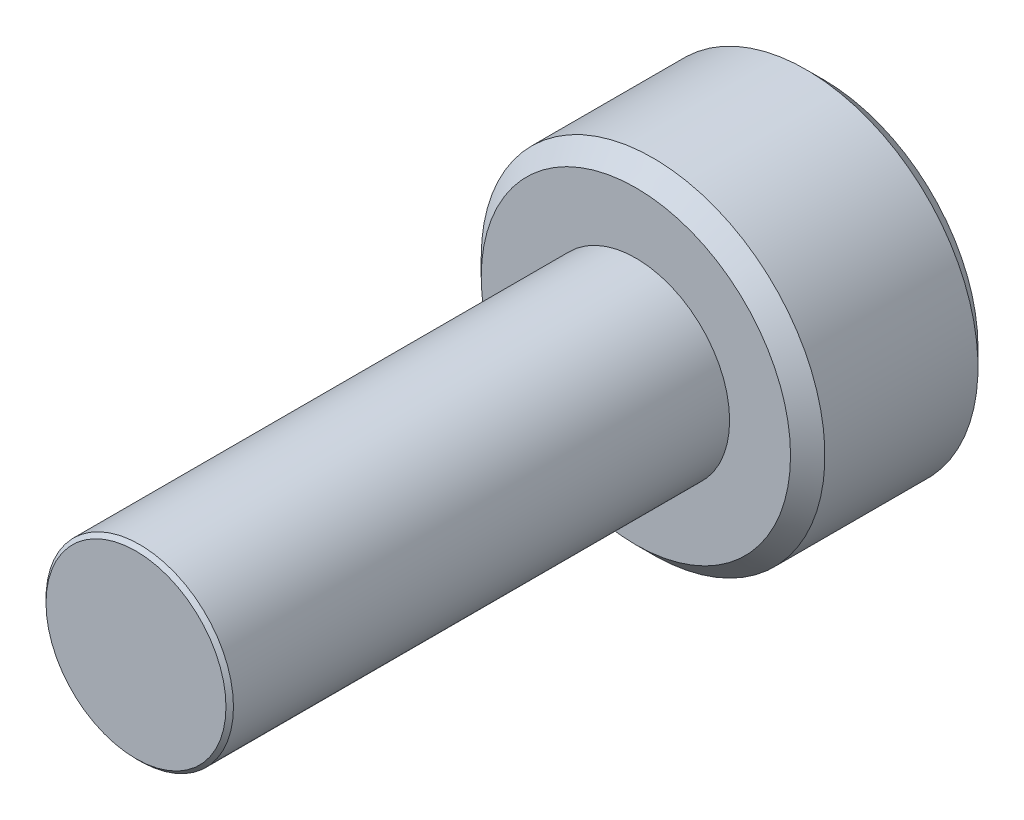
ISO-10303-21;
HEADER;
FILE_DESCRIPTION(('STEP AP214'),'2;1');
FILE_NAME('part.step','',(''),(''),'','','');
FILE_SCHEMA(('AUTOMOTIVE_DESIGN { 1 0 10303 214 1 1 1 1 }'));
ENDSEC;
DATA;
#1=APPLICATION_CONTEXT('core data for automotive mechanical design processes');
#2=APPLICATION_PROTOCOL_DEFINITION('international standard','automotive_design',2000,#1);
#3=PRODUCT_CONTEXT('',#1,'mechanical');
#4=PRODUCT('Part','Part','',(#3));
#5=PRODUCT_RELATED_PRODUCT_CATEGORY('part','',(#4));
#6=PRODUCT_DEFINITION_FORMATION('','',#4);
#7=PRODUCT_DEFINITION_CONTEXT('part definition',#1,'design');
#8=PRODUCT_DEFINITION('design','',#6,#7);
#9=PRODUCT_DEFINITION_SHAPE('','',#8);
#10=(LENGTH_UNIT() NAMED_UNIT(*) SI_UNIT(.MILLI.,.METRE.));
#11=(NAMED_UNIT(*) PLANE_ANGLE_UNIT() SI_UNIT($,.RADIAN.));
#12=(NAMED_UNIT(*) SI_UNIT($,.STERADIAN.) SOLID_ANGLE_UNIT());
#13=UNCERTAINTY_MEASURE_WITH_UNIT(LENGTH_MEASURE(1.E-05),#10,'distance_accuracy_value','');
#14=(GEOMETRIC_REPRESENTATION_CONTEXT(3) GLOBAL_UNCERTAINTY_ASSIGNED_CONTEXT((#13)) GLOBAL_UNIT_ASSIGNED_CONTEXT((#10,
#11,#12)) REPRESENTATION_CONTEXT('',''));
#15=CARTESIAN_POINT('',(0.,0.,0.));
#16=DIRECTION('',(0.,0.,1.));
#17=DIRECTION('',(1.,0.,0.));
#18=AXIS2_PLACEMENT_3D('',#15,#16,#17);
#19=CARTESIAN_POINT('',(0.,0.,-8.));
#20=DIRECTION('',(0.,0.,-1.));
#21=DIRECTION('',(-1.,0.,0.));
#22=AXIS2_PLACEMENT_3D('',#19,#20,#21);
#23=PLANE('',#22);
#24=CARTESIAN_POINT('',(0.,0.,-8.));
#25=DIRECTION('',(0.,0.,-1.));
#26=DIRECTION('',(-1.,0.,0.));
#27=AXIS2_PLACEMENT_3D('',#24,#25,#26);
#28=CIRCLE('',#27,2.475);
#29=CARTESIAN_POINT('',(-2.475,0.,-8.));
#30=VERTEX_POINT('',#29);
#31=EDGE_CURVE('E11',#30,#30,#28,.F.);
#32=ORIENTED_EDGE('',*,*,#31,.T.);
#33=EDGE_LOOP('',(#32));
#34=FACE_BOUND('',#33,.T.);
#35=CARTESIAN_POINT('',(0.,0.,-8.));
#36=DIRECTION('',(0.,0.,1.));
#37=DIRECTION('',(1.,0.,0.));
#38=AXIS2_PLACEMENT_3D('',#35,#36,#37);
#39=CIRCLE('',#38,1.5);
#40=CARTESIAN_POINT('',(1.5,0.,-8.));
#41=VERTEX_POINT('',#40);
#42=EDGE_CURVE('E118',#41,#41,#39,.T.);
#43=ORIENTED_EDGE('',*,*,#42,.F.);
#44=EDGE_LOOP('',(#43));
#45=FACE_BOUND('',#44,.T.);
#46=ADVANCED_FACE('F41',(#34,#45),#23,.F.);
#47=CARTESIAN_POINT('',(0.,0.,-8.));
#48=DIRECTION('',(0.,0.,1.));
#49=DIRECTION('',(1.,0.,0.));
#50=AXIS2_PLACEMENT_3D('',#47,#48,#49);
#51=CYLINDRICAL_SURFACE('',#50,1.5);
#52=ORIENTED_EDGE('',*,*,#42,.T.);
#53=EDGE_LOOP('',(#52));
#54=FACE_BOUND('',#53,.T.);
#55=CARTESIAN_POINT('',(0.,0.,-0.0599999999999993));
#56=DIRECTION('',(0.,0.,1.));
#57=DIRECTION('',(1.,0.,0.));
#58=AXIS2_PLACEMENT_3D('',#55,#56,#57);
#59=CIRCLE('',#58,1.5);
#60=CARTESIAN_POINT('',(1.5,0.,-0.0599999999999993));
#61=VERTEX_POINT('',#60);
#62=EDGE_CURVE('E146',#61,#61,#59,.F.);
#63=ORIENTED_EDGE('',*,*,#62,.T.);
#64=EDGE_LOOP('',(#63));
#65=FACE_BOUND('',#64,.T.);
#66=ADVANCED_FACE('F212',(#54,#65),#51,.T.);
#67=CARTESIAN_POINT('',(0.,0.,-11.));
#68=DIRECTION('',(0.,0.,1.));
#69=DIRECTION('',(1.,0.,0.));
#70=AXIS2_PLACEMENT_3D('',#67,#68,#69);
#71=CYLINDRICAL_SURFACE('',#70,2.75);
#72=CARTESIAN_POINT('',(0.,0.,-10.725));
#73=DIRECTION('',(0.,0.,-1.));
#74=DIRECTION('',(-1.,0.,0.));
#75=AXIS2_PLACEMENT_3D('',#72,#73,#74);
#76=CIRCLE('',#75,2.75);
#77=CARTESIAN_POINT('',(-2.75,0.,-10.725));
#78=VERTEX_POINT('',#77);
#79=EDGE_CURVE('E50',#78,#78,#76,.F.);
#80=ORIENTED_EDGE('',*,*,#79,.T.);
#81=EDGE_LOOP('',(#80));
#82=FACE_BOUND('',#81,.T.);
#83=CARTESIAN_POINT('',(0.,0.,-8.275));
#84=DIRECTION('',(0.,0.,-1.));
#85=DIRECTION('',(-1.,0.,0.));
#86=AXIS2_PLACEMENT_3D('',#83,#84,#85);
#87=CIRCLE('',#86,2.75);
#88=CARTESIAN_POINT('',(-2.75,0.,-8.275));
#89=VERTEX_POINT('',#88);
#90=EDGE_CURVE('E190',#89,#89,#87,.T.);
#91=ORIENTED_EDGE('',*,*,#90,.T.);
#92=EDGE_LOOP('',(#91));
#93=FACE_BOUND('',#92,.T.);
#94=ADVANCED_FACE('F197',(#82,#93),#71,.T.);
#95=CARTESIAN_POINT('',(0.,0.,-11.));
#96=DIRECTION('',(0.,0.,-1.));
#97=DIRECTION('',(-1.,0.,0.));
#98=AXIS2_PLACEMENT_3D('',#95,#96,#97);
#99=PLANE('',#98);
#100=CARTESIAN_POINT('',(0.,0.,-11.));
#101=DIRECTION('',(0.,0.,-1.));
#102=DIRECTION('',(-1.,0.,0.));
#103=AXIS2_PLACEMENT_3D('',#100,#101,#102);
#104=CIRCLE('',#103,2.475);
#105=CARTESIAN_POINT('',(-2.475,0.,-11.));
#106=VERTEX_POINT('',#105);
#107=EDGE_CURVE('E117',#106,#106,#104,.T.);
#108=ORIENTED_EDGE('',*,*,#107,.T.);
#109=EDGE_LOOP('',(#108));
#110=FACE_BOUND('',#109,.T.);
#111=CARTESIAN_POINT('',(0.,0.,-11.));
#112=DIRECTION('',(0.,0.,-1.));
#113=DIRECTION('',(-1.,0.,0.));
#114=AXIS2_PLACEMENT_3D('',#111,#112,#113);
#115=CIRCLE('',#114,1.44337567297406);
#116=CARTESIAN_POINT('',(-1.25,0.721687836487031,-11.));
#117=VERTEX_POINT('',#116);
#118=CARTESIAN_POINT('',(0.,1.44337567297406,-11.));
#119=VERTEX_POINT('',#118);
#120=EDGE_CURVE('E96',#117,#119,#115,.T.);
#121=ORIENTED_EDGE('',*,*,#120,.F.);
#122=CARTESIAN_POINT('',(-1.25,-0.721687836487032,-11.));
#123=VERTEX_POINT('',#122);
#124=EDGE_CURVE('E56',#123,#117,#115,.T.);
#125=ORIENTED_EDGE('',*,*,#124,.F.);
#126=CARTESIAN_POINT('',(0.,-1.44337567297406,-11.));
#127=VERTEX_POINT('',#126);
#128=EDGE_CURVE('E242',#127,#123,#115,.T.);
#129=ORIENTED_EDGE('',*,*,#128,.F.);
#130=CARTESIAN_POINT('',(1.25,-0.721687836487032,-11.));
#131=VERTEX_POINT('',#130);
#132=EDGE_CURVE('E63',#131,#127,#115,.T.);
#133=ORIENTED_EDGE('',*,*,#132,.F.);
#134=CARTESIAN_POINT('',(1.25,0.721687836487033,-11.));
#135=VERTEX_POINT('',#134);
#136=EDGE_CURVE('E141',#135,#131,#115,.T.);
#137=ORIENTED_EDGE('',*,*,#136,.F.);
#138=EDGE_CURVE('E106',#119,#135,#115,.T.);
#139=ORIENTED_EDGE('',*,*,#138,.F.);
#140=EDGE_LOOP('',(#121,#125,#129,#133,#137,#139));
#141=FACE_BOUND('',#140,.T.);
#142=ADVANCED_FACE('F140',(#110,#141),#99,.T.);
#143=CARTESIAN_POINT('',(0.,0.,-11.));
#144=DIRECTION('',(0.,0.,-1.));
#145=DIRECTION('',(-1.,0.,0.));
#146=AXIS2_PLACEMENT_3D('',#143,#144,#145);
#147=CONICAL_SURFACE('',#146,1.44337567297406,0.78539816339745);
#148=ORIENTED_EDGE('',*,*,#138,.T.);
#149=CARTESIAN_POINT('',(-0.000199999999999518,1.4434911430279,-11.0001154839091));
#150=CARTESIAN_POINT('',(0.0427751670715875,1.41867941875065,-10.9753216680551));
#151=CARTESIAN_POINT('',(0.0864690047459492,1.39345276980743,-10.9519837344187));
#152=CARTESIAN_POINT('',(0.175565930841943,1.34201263554194,-10.9092520040845));
#153=CARTESIAN_POINT('',(0.220977498357065,1.31579425481276,-10.8898819923604));
#154=CARTESIAN_POINT('',(0.312547820935261,1.26292610442246,-10.8567004834135));
#155=CARTESIAN_POINT('',(0.358683240175887,1.23628980770471,-10.8428055590527));
#156=CARTESIAN_POINT('',(0.451970080407593,1.18243062538508,-10.8213972821606));
#157=CARTESIAN_POINT('',(0.499118649136381,1.15520938653761,-10.8138679415668));
#158=CARTESIAN_POINT('',(0.580373556887253,1.10829684367467,-10.8070744980507));
#159=CARTESIAN_POINT('',(0.614374876627942,1.08866617256958,-10.8060685591043));
#160=CARTESIAN_POINT('',(0.682317764432479,1.04943932800611,-10.8077614149113));
#161=CARTESIAN_POINT('',(0.716259317655658,1.02984316311599,-10.8104610272155));
#162=CARTESIAN_POINT('',(0.7838148564575,0.990839954603498,-10.8194089303164));
#163=CARTESIAN_POINT('',(0.817428507286776,0.97143310424877,-10.8256605258997));
#164=CARTESIAN_POINT('',(0.884094638217814,0.932943395609905,-10.8413756814139));
#165=CARTESIAN_POINT('',(0.917146871030297,0.9138606800983,-10.8508406200875));
#166=CARTESIAN_POINT('',(1.00179969160026,0.864986351354567,-10.8789313906876));
#167=CARTESIAN_POINT('',(1.05286649242964,0.835502920149076,-10.8996701574522));
#168=CARTESIAN_POINT('',(1.15300085411325,0.777690319475909,-10.9463871346715));
#169=CARTESIAN_POINT('',(1.20207431157827,0.749357745598417,-10.9723482959468));
#170=CARTESIAN_POINT('',(1.2502,0.721572366433194,-11.0001154839091));
#171=B_SPLINE_CURVE_WITH_KNOTS('',3,(#149,#150,#151,#152,#153,#154,#155,#156,#157,#158,#159,
#160,#161,#162,#163,#164,#165,#166,#167,#168,#169,#170),.UNSPECIFIED.,.F.,.F.,(4,2,2,2,2,2,2,2,
2,2,4),(0.,0.166533409618305,0.334037607289762,0.498880396489699,0.663307919240275,
0.780963963458827,0.898645970148453,1.01643764860773,1.1342799317155,1.32148652032141,
1.50809158792573),.UNSPECIFIED.);
#172=EDGE_CURVE('E111',#119,#135,#171,.T.);
#173=ORIENTED_EDGE('',*,*,#172,.F.);
#174=EDGE_LOOP('',(#148,#173));
#175=FACE_BOUND('',#174,.T.);
#176=ADVANCED_FACE('F112',(#175),#147,.F.);
#177=ORIENTED_EDGE('',*,*,#136,.T.);
#178=CARTESIAN_POINT('',(1.25,-1.43934010808077,-11.4629820968923));
#179=CARTESIAN_POINT('',(1.25,-1.40429313005659,-11.4365249226329));
#180=CARTESIAN_POINT('',(1.25,-1.36905087135599,-11.4103271603543));
#181=CARTESIAN_POINT('',(1.25,-1.29809650706311,-11.3585575718396));
#182=CARTESIAN_POINT('',(1.25,-1.26238428576495,-11.3329859043563));
#183=CARTESIAN_POINT('',(1.25,-1.15390111792708,-11.2570059936895));
#184=CARTESIAN_POINT('',(1.25,-1.08031646726264,-11.2077402861896));
#185=CARTESIAN_POINT('',(1.25,-0.926012322755096,-11.1110258302631));
#186=CARTESIAN_POINT('',(1.25,-0.845125318656147,-11.0638412989418));
#187=CARTESIAN_POINT('',(1.25,-0.679311174076603,-10.9775307343904));
#188=CARTESIAN_POINT('',(1.25,-0.594398891026688,-10.9383775346269));
#189=CARTESIAN_POINT('',(1.25,-0.46694481246074,-10.8904772236883));
#190=CARTESIAN_POINT('',(1.25,-0.426289985812821,-10.8767294897863));
#191=CARTESIAN_POINT('',(1.25,-0.343998850091267,-10.8524979274505));
#192=CARTESIAN_POINT('',(1.25,-0.302362473614962,-10.8420143238698));
#193=CARTESIAN_POINT('',(1.25,-0.219052696285665,-10.8250301617483));
#194=CARTESIAN_POINT('',(1.25,-0.1773934284745,-10.8184613604714));
#195=CARTESIAN_POINT('',(1.25,-0.0936293693401921,-10.8094350534578));
#196=CARTESIAN_POINT('',(1.25,-0.051524655854396,-10.8069768409973));
#197=CARTESIAN_POINT('',(1.25,0.0311890576306316,-10.8063540620133));
#198=CARTESIAN_POINT('',(1.25,0.0717969625499305,-10.8080371168462));
#199=CARTESIAN_POINT('',(1.25,0.152668636885197,-10.8152682705979));
#200=CARTESIAN_POINT('',(1.25,0.192932338835358,-10.8208171104131));
#201=CARTESIAN_POINT('',(1.25,0.273499879165296,-10.835571036465));
#202=CARTESIAN_POINT('',(1.25,0.313792180618512,-10.8448381759641));
#203=CARTESIAN_POINT('',(1.25,0.393496413911458,-10.8665361784573));
#204=CARTESIAN_POINT('',(1.25,0.43290841911506,-10.8789667767306));
#205=CARTESIAN_POINT('',(1.25,0.556992735862298,-10.9227793529314));
#206=CARTESIAN_POINT('',(1.25,0.639898924666086,-10.959151072876));
#207=CARTESIAN_POINT('',(1.25,0.801816555499702,-11.0400191621783));
#208=CARTESIAN_POINT('',(1.25,0.880812666325046,-11.084544720912));
#209=CARTESIAN_POINT('',(1.25,1.0317856127975,-11.1764048766666));
#210=CARTESIAN_POINT('',(1.25,1.10391618485086,-11.2234899339162));
#211=CARTESIAN_POINT('',(1.25,1.21018606043311,-11.2962785615985));
#212=CARTESIAN_POINT('',(1.25,1.2451506996938,-11.3207980853934));
#213=CARTESIAN_POINT('',(1.25,1.31460220852737,-11.3704856367657));
#214=CARTESIAN_POINT('',(1.25,1.34908920596618,-11.3956534854155));
#215=CARTESIAN_POINT('',(1.25,1.38337731682912,-11.4210901488412));
#216=B_SPLINE_CURVE_WITH_KNOTS('',3,(#178,#179,#180,#181,#182,#183,#184,#185,#186,#187,#188,
#189,#190,#191,#192,#193,#194,#195,#196,#197,#198,#199,#200,#201,#202,#203,#204,#205,#206,#207,
#208,#209,#210,#211,#212,#213,#214,#215),.UNSPECIFIED.,.F.,.F.,(4,2,2,2,2,2,2,2,2,2,2,2,2,2,2,2,
2,2,4),(0.,0.131732960381448,0.263498984161645,0.529042014455825,0.809741926134617,
1.08947609717225,1.21811634272576,1.346765447839,1.47310084517844,1.59941451973784,
1.72115042167849,1.84290966131735,1.96679153905342,2.09066305366039,2.36146692896009,
2.63325989198491,2.89154668212279,3.01965734507713,3.14773302245628),.UNSPECIFIED.);
#217=EDGE_CURVE('E105',#135,#131,#216,.F.);
#218=ORIENTED_EDGE('',*,*,#217,.F.);
#219=EDGE_LOOP('',(#177,#218));
#220=FACE_BOUND('',#219,.T.);
#221=ADVANCED_FACE('F211',(#220),#147,.F.);
#222=ORIENTED_EDGE('',*,*,#132,.T.);
#223=CARTESIAN_POINT('',(1.2502,-0.721572366433195,-11.0001154839091));
#224=CARTESIAN_POINT('',(1.20722483292841,-0.746384090710445,-10.9753216680551));
#225=CARTESIAN_POINT('',(1.16353099525405,-0.771610739653665,-10.9519837344187));
#226=CARTESIAN_POINT('',(1.07443406915806,-0.823050873919155,-10.9092520040845));
#227=CARTESIAN_POINT('',(1.02902250164294,-0.849269254648334,-10.8898819923604));
#228=CARTESIAN_POINT('',(0.93745217906474,-0.902137405038636,-10.8567004834135));
#229=CARTESIAN_POINT('',(0.891316759824114,-0.928773701756388,-10.8428055590527));
#230=CARTESIAN_POINT('',(0.798029919592408,-0.982632884076013,-10.8213972821606));
#231=CARTESIAN_POINT('',(0.75088135086362,-1.00985412292348,-10.8138679415668));
#232=CARTESIAN_POINT('',(0.669626443112748,-1.05676666578643,-10.8070744980507));
#233=CARTESIAN_POINT('',(0.63562512337206,-1.07639733689152,-10.8060685591043));
#234=CARTESIAN_POINT('',(0.567682235567523,-1.11562418145499,-10.8077614149113));
#235=CARTESIAN_POINT('',(0.533740682344343,-1.1352203463451,-10.8104610272155));
#236=CARTESIAN_POINT('',(0.466185143542501,-1.1742235548576,-10.8194089303164));
#237=CARTESIAN_POINT('',(0.432571492713226,-1.19363040521233,-10.8256605258997));
#238=CARTESIAN_POINT('',(0.365905361782187,-1.23212011385119,-10.8413756814139));
#239=CARTESIAN_POINT('',(0.332853128969705,-1.2512028293628,-10.8508406200875));
#240=CARTESIAN_POINT('',(0.248200308399736,-1.30007715810653,-10.8789313906876));
#241=CARTESIAN_POINT('',(0.197133507570362,-1.32956058931202,-10.8996701574522));
#242=CARTESIAN_POINT('',(0.0969991458867458,-1.38737318998519,-10.9463871346715));
#243=CARTESIAN_POINT('',(0.0479256884217313,-1.41570576386268,-10.9723482959468));
#244=CARTESIAN_POINT('',(-0.000199999999999432,-1.4434911430279,-11.0001154839091));
#245=B_SPLINE_CURVE_WITH_KNOTS('',3,(#223,#224,#225,#226,#227,#228,#229,#230,#231,#232,#233,
#234,#235,#236,#237,#238,#239,#240,#241,#242,#243,#244),.UNSPECIFIED.,.F.,.F.,(4,2,2,2,2,2,2,2,
2,2,4),(0.,0.166533409618304,0.334037607289761,0.498880396489698,0.663307919240274,
0.780963963458826,0.898645970148452,1.01643764860773,1.13427993171549,1.32148652032141,
1.50809158792573),.UNSPECIFIED.);
#246=EDGE_CURVE('E157',#131,#127,#245,.T.);
#247=ORIENTED_EDGE('',*,*,#246,.F.);
#248=EDGE_LOOP('',(#222,#247));
#249=FACE_BOUND('',#248,.T.);
#250=ADVANCED_FACE('F334',(#249),#147,.F.);
#251=ORIENTED_EDGE('',*,*,#128,.T.);
#252=CARTESIAN_POINT('',(0.000200000000000315,-1.4434911430279,-11.0001154839091));
#253=CARTESIAN_POINT('',(-0.0427751670715862,-1.41867941875065,-10.9753216680551));
#254=CARTESIAN_POINT('',(-0.0864690047459475,-1.39345276980743,-10.9519837344187));
#255=CARTESIAN_POINT('',(-0.175565930841941,-1.34201263554194,-10.9092520040845));
#256=CARTESIAN_POINT('',(-0.220977498357063,-1.31579425481276,-10.8898819923604));
#257=CARTESIAN_POINT('',(-0.312547820935259,-1.26292610442246,-10.8567004834135));
#258=CARTESIAN_POINT('',(-0.358683240175885,-1.23628980770471,-10.8428055590527));
#259=CARTESIAN_POINT('',(-0.451970080407592,-1.18243062538508,-10.8213972821606));
#260=CARTESIAN_POINT('',(-0.499118649136379,-1.15520938653761,-10.8138679415668));
#261=CARTESIAN_POINT('',(-0.580373556887252,-1.10829684367467,-10.8070744980507));
#262=CARTESIAN_POINT('',(-0.61437487662794,-1.08866617256958,-10.8060685591043));
#263=CARTESIAN_POINT('',(-0.682317764432477,-1.04943932800611,-10.8077614149113));
#264=CARTESIAN_POINT('',(-0.716259317655657,-1.02984316311599,-10.8104610272155));
#265=CARTESIAN_POINT('',(-0.783814856457499,-0.9908399546035,-10.8194089303164));
#266=CARTESIAN_POINT('',(-0.817428507286774,-0.971433104248772,-10.8256605258997));
#267=CARTESIAN_POINT('',(-0.884094638217813,-0.932943395609906,-10.8413756814139));
#268=CARTESIAN_POINT('',(-0.917146871030295,-0.913860680098301,-10.8508406200875));
#269=CARTESIAN_POINT('',(-1.00179969160026,-0.864986351354568,-10.8789313906876));
#270=CARTESIAN_POINT('',(-1.05286649242964,-0.835502920149076,-10.8996701574522));
#271=CARTESIAN_POINT('',(-1.15300085411326,-0.777690319475909,-10.9463871346715));
#272=CARTESIAN_POINT('',(-1.20207431157827,-0.749357745598417,-10.9723482959468));
#273=CARTESIAN_POINT('',(-1.2502,-0.721572366433195,-11.0001154839091));
#274=B_SPLINE_CURVE_WITH_KNOTS('',3,(#252,#253,#254,#255,#256,#257,#258,#259,#260,#261,#262,
#263,#264,#265,#266,#267,#268,#269,#270,#271,#272,#273),.UNSPECIFIED.,.F.,.F.,(4,2,2,2,2,2,2,2,
2,2,4),(0.,0.166533409618303,0.334037607289761,0.498880396489698,0.663307919240274,
0.780963963458826,0.898645970148453,1.01643764860773,1.13427993171549,1.32148652032141,
1.50809158792574),.UNSPECIFIED.);
#275=EDGE_CURVE('E250',#127,#123,#274,.T.);
#276=ORIENTED_EDGE('',*,*,#275,.F.);
#277=EDGE_LOOP('',(#251,#276));
#278=FACE_BOUND('',#277,.T.);
#279=ADVANCED_FACE('F248',(#278),#147,.F.);
#280=ORIENTED_EDGE('',*,*,#124,.T.);
#281=CARTESIAN_POINT('',(-1.25,-1.43934010829019,-11.4629820970504));
#282=CARTESIAN_POINT('',(-1.25,-1.40429313026013,-11.4365249227849));
#283=CARTESIAN_POINT('',(-1.25,-1.36905087155364,-11.4103271605002));
#284=CARTESIAN_POINT('',(-1.25,-1.29809650724891,-11.3585575719734));
#285=CARTESIAN_POINT('',(-1.25,-1.2623842859448,-11.3329859044841));
#286=CARTESIAN_POINT('',(-1.25,-1.1539011180887,-11.257005993799));
#287=CARTESIAN_POINT('',(-1.25,-1.08031646741187,-11.207740286287));
#288=CARTESIAN_POINT('',(-1.25,-0.926012322877301,-11.1110258303356));
#289=CARTESIAN_POINT('',(-1.25,-0.845125318763647,-11.0638412990016));
#290=CARTESIAN_POINT('',(-1.25,-0.679311174153443,-10.9775307344266));
#291=CARTESIAN_POINT('',(-1.25,-0.594398891087584,-10.9383775346522));
#292=CARTESIAN_POINT('',(-1.25,-0.466944812509639,-10.8904772237056));
#293=CARTESIAN_POINT('',(-1.25,-0.426289985866744,-10.8767294898039));
#294=CARTESIAN_POINT('',(-1.25,-0.343998850155403,-10.8524979274677));
#295=CARTESIAN_POINT('',(-1.25,-0.302362473684286,-10.8420143238863));
#296=CARTESIAN_POINT('',(-1.25,-0.219052696365195,-10.8250301617622));
#297=CARTESIAN_POINT('',(-1.25,-0.177393428559044,-10.8184613604834));
#298=CARTESIAN_POINT('',(-1.25,-0.0936293694345982,-10.809435053465));
#299=CARTESIAN_POINT('',(-1.25,-0.0515246559536489,-10.8069768410015));
#300=CARTESIAN_POINT('',(-1.25,0.0311890575224387,-10.8063540620107));
#301=CARTESIAN_POINT('',(-1.25,0.0717969624376319,-10.8080371168399));
#302=CARTESIAN_POINT('',(-1.25,0.152668636765093,-10.8152682705835));
#303=CARTESIAN_POINT('',(-1.25,0.192932338711554,-10.8208171103943));
#304=CARTESIAN_POINT('',(-1.25,0.273499879034189,-10.835571036437));
#305=CARTESIAN_POINT('',(-1.25,0.313792180483814,-10.8448381759314));
#306=CARTESIAN_POINT('',(-1.25,0.393496413769925,-10.8665361784149));
#307=CARTESIAN_POINT('',(-1.25,0.432908418970283,-10.8789667766833));
#308=CARTESIAN_POINT('',(-1.25,0.556992735685997,-10.9227793528609));
#309=CARTESIAN_POINT('',(-1.25,0.639898924463083,-10.9591510727842));
#310=CARTESIAN_POINT('',(-1.25,0.801816555245347,-11.0400191620416));
#311=CARTESIAN_POINT('',(-1.25,0.880812666046053,-11.0845447207516));
#312=CARTESIAN_POINT('',(-1.25,1.03178561247421,-11.176404876461));
#313=CARTESIAN_POINT('',(-1.25,1.10391618450775,-11.2234899336892));
#314=CARTESIAN_POINT('',(-1.25,1.2101860600607,-11.2962785613395));
#315=CARTESIAN_POINT('',(-1.25,1.24515069931176,-11.3207980851238));
#316=CARTESIAN_POINT('',(-1.25,1.31460220812614,-11.3704856364749));
#317=CARTESIAN_POINT('',(-1.25,1.3490892055554,-11.3956534851142));
#318=CARTESIAN_POINT('',(-1.25,1.38337731640879,-11.4210901485293));
#319=B_SPLINE_CURVE_WITH_KNOTS('',3,(#281,#282,#283,#284,#285,#286,#287,#288,#289,#290,#291,
#292,#293,#294,#295,#296,#297,#298,#299,#300,#301,#302,#303,#304,#305,#306,#307,#308,#309,#310,
#311,#312,#313,#314,#315,#316,#317,#318),.UNSPECIFIED.,.F.,.F.,(4,2,2,2,2,2,2,2,2,2,2,2,2,2,2,2,
2,2,4),(0.,0.131732960406521,0.263498984211801,0.529042014557081,0.809741926293178,
1.08947609738757,1.21811634292656,1.34676544802529,1.47310084535082,1.59941451989631,
1.72115042182424,1.84290966145034,1.96679153917269,2.09066305376595,2.36146692896707,
2.63325989189267,2.89154668194565,3.01965734485811,3.1477330221954),.UNSPECIFIED.);
#320=EDGE_CURVE('E129',#123,#117,#319,.T.);
#321=ORIENTED_EDGE('',*,*,#320,.F.);
#322=EDGE_LOOP('',(#280,#321));
#323=FACE_BOUND('',#322,.T.);
#324=ADVANCED_FACE('F353',(#323),#147,.F.);
#325=ORIENTED_EDGE('',*,*,#120,.T.);
#326=CARTESIAN_POINT('',(-1.2502,0.721572366433194,-11.0001154839091));
#327=CARTESIAN_POINT('',(-1.20722483292841,0.746384090710444,-10.9753216680551));
#328=CARTESIAN_POINT('',(-1.16353099525405,0.771610739653664,-10.9519837344187));
#329=CARTESIAN_POINT('',(-1.07443406915806,0.823050873919154,-10.9092520040845));
#330=CARTESIAN_POINT('',(-1.02902250164294,0.849269254648333,-10.8898819923604));
#331=CARTESIAN_POINT('',(-0.937452179064741,0.902137405038635,-10.8567004834135));
#332=CARTESIAN_POINT('',(-0.891316759824115,0.928773701756387,-10.8428055590527));
#333=CARTESIAN_POINT('',(-0.798029919592407,0.982632884076013,-10.8213972821606));
#334=CARTESIAN_POINT('',(-0.75088135086362,1.00985412292348,-10.8138679415668));
#335=CARTESIAN_POINT('',(-0.669626443112747,1.05676666578643,-10.8070744980507));
#336=CARTESIAN_POINT('',(-0.635625123372059,1.07639733689152,-10.8060685591043));
#337=CARTESIAN_POINT('',(-0.567682235567522,1.11562418145499,-10.8077614149113));
#338=CARTESIAN_POINT('',(-0.533740682344342,1.1352203463451,-10.8104610272155));
#339=CARTESIAN_POINT('',(-0.4661851435425,1.1742235548576,-10.8194089303164));
#340=CARTESIAN_POINT('',(-0.432571492713225,1.19363040521233,-10.8256605258997));
#341=CARTESIAN_POINT('',(-0.365905361782186,1.23212011385119,-10.8413756814139));
#342=CARTESIAN_POINT('',(-0.332853128969704,1.2512028293628,-10.8508406200875));
#343=CARTESIAN_POINT('',(-0.248200308399735,1.30007715810653,-10.8789313906876));
#344=CARTESIAN_POINT('',(-0.197133507570361,1.32956058931202,-10.8996701574522));
#345=CARTESIAN_POINT('',(-0.096999145886745,1.38737318998519,-10.9463871346715));
#346=CARTESIAN_POINT('',(-0.0479256884217305,1.41570576386268,-10.9723482959468));
#347=CARTESIAN_POINT('',(0.000200000000000219,1.4434911430279,-11.0001154839091));
#348=B_SPLINE_CURVE_WITH_KNOTS('',3,(#326,#327,#328,#329,#330,#331,#332,#333,#334,#335,#336,
#337,#338,#339,#340,#341,#342,#343,#344,#345,#346,#347),.UNSPECIFIED.,.F.,.F.,(4,2,2,2,2,2,2,2,
2,2,4),(0.,0.166533409618305,0.334037607289762,0.498880396489699,0.663307919240276,
0.780963963458828,0.898645970148454,1.01643764860773,1.1342799317155,1.32148652032141,
1.50809158792574),.UNSPECIFIED.);
#349=EDGE_CURVE('E100',#117,#119,#348,.T.);
#350=ORIENTED_EDGE('',*,*,#349,.F.);
#351=EDGE_LOOP('',(#325,#350));
#352=FACE_BOUND('',#351,.T.);
#353=ADVANCED_FACE('F98',(#352),#147,.F.);
#354=CARTESIAN_POINT('',(1.25,2.1650635094611,-9.125));
#355=DIRECTION('',(0.,0.,-1.));
#356=DIRECTION('',(-1.,0.,0.));
#357=AXIS2_PLACEMENT_3D('',#354,#355,#356);
#358=PLANE('',#357);
#359=DIRECTION('',(0.866025403784439,0.5,0.));
#360=VECTOR('',#359,1.);
#361=CARTESIAN_POINT('',(-1.25,0.721687836487032,-9.125));
#362=LINE('',#361,#360);
#363=CARTESIAN_POINT('',(-1.25,0.721687836487032,-9.125));
#364=VERTEX_POINT('',#363);
#365=CARTESIAN_POINT('',(0.,1.44337567297406,-9.125));
#366=VERTEX_POINT('',#365);
#367=EDGE_CURVE('E128',#364,#366,#362,.T.);
#368=ORIENTED_EDGE('',*,*,#367,.T.);
#369=DIRECTION('',(0.866025403784439,-0.5,0.));
#370=VECTOR('',#369,1.);
#371=CARTESIAN_POINT('',(0.,1.44337567297406,-9.125));
#372=LINE('',#371,#370);
#373=CARTESIAN_POINT('',(1.25,0.721687836487032,-9.125));
#374=VERTEX_POINT('',#373);
#375=EDGE_CURVE('E133',#366,#374,#372,.T.);
#376=ORIENTED_EDGE('',*,*,#375,.T.);
#377=DIRECTION('',(0.,-1.,0.));
#378=VECTOR('',#377,1.);
#379=CARTESIAN_POINT('',(1.25,0.721687836487032,-9.125));
#380=LINE('',#379,#378);
#381=CARTESIAN_POINT('',(1.25,-0.721687836487033,-9.125));
#382=VERTEX_POINT('',#381);
#383=EDGE_CURVE('E278',#374,#382,#380,.T.);
#384=ORIENTED_EDGE('',*,*,#383,.T.);
#385=DIRECTION('',(-0.866025403784439,-0.5,0.));
#386=VECTOR('',#385,1.);
#387=CARTESIAN_POINT('',(1.25,-0.721687836487033,-9.125));
#388=LINE('',#387,#386);
#389=CARTESIAN_POINT('',(0.,-1.44337567297406,-9.125));
#390=VERTEX_POINT('',#389);
#391=EDGE_CURVE('E281',#382,#390,#388,.T.);
#392=ORIENTED_EDGE('',*,*,#391,.T.);
#393=DIRECTION('',(-0.866025403784439,0.5,0.));
#394=VECTOR('',#393,1.);
#395=CARTESIAN_POINT('',(0.,-1.44337567297406,-9.125));
#396=LINE('',#395,#394);
#397=CARTESIAN_POINT('',(-1.25,-0.721687836487032,-9.125));
#398=VERTEX_POINT('',#397);
#399=EDGE_CURVE('E264',#390,#398,#396,.T.);
#400=ORIENTED_EDGE('',*,*,#399,.T.);
#401=DIRECTION('',(0.,1.,0.));
#402=VECTOR('',#401,1.);
#403=CARTESIAN_POINT('',(-1.25,-0.721687836487032,-9.125));
#404=LINE('',#403,#402);
#405=EDGE_CURVE('E137',#398,#364,#404,.T.);
#406=ORIENTED_EDGE('',*,*,#405,.T.);
#407=EDGE_LOOP('',(#368,#376,#384,#392,#400,#406));
#408=FACE_BOUND('',#407,.T.);
#409=ADVANCED_FACE('F178',(#408),#358,.T.);
#410=CARTESIAN_POINT('',(0.,1.44337567297406,-9.125));
#411=DIRECTION('',(0.5,0.866025403784439,0.));
#412=DIRECTION('',(-0.866025403784439,0.5,0.));
#413=AXIS2_PLACEMENT_3D('',#410,#411,#412);
#414=PLANE('',#413);
#415=DIRECTION('',(0.,0.,-1.));
#416=VECTOR('',#415,1.);
#417=CARTESIAN_POINT('',(0.,1.44337567297406,-9.125));
#418=LINE('',#417,#416);
#419=EDGE_CURVE('E124',#366,#119,#418,.T.);
#420=ORIENTED_EDGE('',*,*,#419,.T.);
#421=ORIENTED_EDGE('',*,*,#172,.T.);
#422=DIRECTION('',(0.,0.,-1.));
#423=VECTOR('',#422,1.);
#424=CARTESIAN_POINT('',(1.25,0.721687836487032,-9.125));
#425=LINE('',#424,#423);
#426=EDGE_CURVE('E136',#374,#135,#425,.T.);
#427=ORIENTED_EDGE('',*,*,#426,.F.);
#428=ORIENTED_EDGE('',*,*,#375,.F.);
#429=EDGE_LOOP('',(#420,#421,#427,#428));
#430=FACE_BOUND('',#429,.T.);
#431=ADVANCED_FACE('F131',(#430),#414,.F.);
#432=CARTESIAN_POINT('',(1.25,0.721687836487032,-9.125));
#433=DIRECTION('',(1.,0.,0.));
#434=DIRECTION('',(0.,0.,-1.));
#435=AXIS2_PLACEMENT_3D('',#432,#433,#434);
#436=PLANE('',#435);
#437=ORIENTED_EDGE('',*,*,#426,.T.);
#438=ORIENTED_EDGE('',*,*,#217,.T.);
#439=DIRECTION('',(0.,0.,-1.));
#440=VECTOR('',#439,1.);
#441=CARTESIAN_POINT('',(1.25,-0.721687836487033,-9.125));
#442=LINE('',#441,#440);
#443=EDGE_CURVE('E260',#382,#131,#442,.T.);
#444=ORIENTED_EDGE('',*,*,#443,.F.);
#445=ORIENTED_EDGE('',*,*,#383,.F.);
#446=EDGE_LOOP('',(#437,#438,#444,#445));
#447=FACE_BOUND('',#446,.T.);
#448=ADVANCED_FACE('F167',(#447),#436,.F.);
#449=CARTESIAN_POINT('',(1.25,-0.721687836487033,-9.125));
#450=DIRECTION('',(0.5,-0.866025403784439,0.));
#451=DIRECTION('',(0.866025403784439,0.5,0.));
#452=AXIS2_PLACEMENT_3D('',#449,#450,#451);
#453=PLANE('',#452);
#454=ORIENTED_EDGE('',*,*,#443,.T.);
#455=ORIENTED_EDGE('',*,*,#246,.T.);
#456=DIRECTION('',(0.,0.,-1.));
#457=VECTOR('',#456,1.);
#458=CARTESIAN_POINT('',(0.,-1.44337567297406,-9.125));
#459=LINE('',#458,#457);
#460=EDGE_CURVE('E258',#390,#127,#459,.T.);
#461=ORIENTED_EDGE('',*,*,#460,.F.);
#462=ORIENTED_EDGE('',*,*,#391,.F.);
#463=EDGE_LOOP('',(#454,#455,#461,#462));
#464=FACE_BOUND('',#463,.T.);
#465=ADVANCED_FACE('F171',(#464),#453,.F.);
#466=CARTESIAN_POINT('',(0.,-1.44337567297406,-9.125));
#467=DIRECTION('',(-0.5,-0.866025403784439,0.));
#468=DIRECTION('',(0.866025403784439,-0.5,0.));
#469=AXIS2_PLACEMENT_3D('',#466,#467,#468);
#470=PLANE('',#469);
#471=ORIENTED_EDGE('',*,*,#460,.T.);
#472=ORIENTED_EDGE('',*,*,#275,.T.);
#473=DIRECTION('',(0.,0.,-1.));
#474=VECTOR('',#473,1.);
#475=CARTESIAN_POINT('',(-1.25,-0.721687836487032,-9.125));
#476=LINE('',#475,#474);
#477=EDGE_CURVE('E267',#398,#123,#476,.T.);
#478=ORIENTED_EDGE('',*,*,#477,.F.);
#479=ORIENTED_EDGE('',*,*,#399,.F.);
#480=EDGE_LOOP('',(#471,#472,#478,#479));
#481=FACE_BOUND('',#480,.T.);
#482=ADVANCED_FACE('F262',(#481),#470,.F.);
#483=CARTESIAN_POINT('',(-1.25,-0.721687836487032,-9.125));
#484=DIRECTION('',(-1.,0.,0.));
#485=DIRECTION('',(0.,-1.,0.));
#486=AXIS2_PLACEMENT_3D('',#483,#484,#485);
#487=PLANE('',#486);
#488=ORIENTED_EDGE('',*,*,#477,.T.);
#489=ORIENTED_EDGE('',*,*,#320,.T.);
#490=DIRECTION('',(0.,0.,-1.));
#491=VECTOR('',#490,1.);
#492=CARTESIAN_POINT('',(-1.25,0.721687836487032,-9.125));
#493=LINE('',#492,#491);
#494=EDGE_CURVE('E126',#364,#117,#493,.T.);
#495=ORIENTED_EDGE('',*,*,#494,.F.);
#496=ORIENTED_EDGE('',*,*,#405,.F.);
#497=EDGE_LOOP('',(#488,#489,#495,#496));
#498=FACE_BOUND('',#497,.T.);
#499=ADVANCED_FACE('F300',(#498),#487,.F.);
#500=CARTESIAN_POINT('',(-1.25,0.721687836487032,-9.125));
#501=DIRECTION('',(-0.5,0.866025403784439,0.));
#502=DIRECTION('',(-0.866025403784439,-0.5,0.));
#503=AXIS2_PLACEMENT_3D('',#500,#501,#502);
#504=PLANE('',#503);
#505=ORIENTED_EDGE('',*,*,#494,.T.);
#506=ORIENTED_EDGE('',*,*,#349,.T.);
#507=ORIENTED_EDGE('',*,*,#419,.F.);
#508=ORIENTED_EDGE('',*,*,#367,.F.);
#509=EDGE_LOOP('',(#505,#506,#507,#508));
#510=FACE_BOUND('',#509,.T.);
#511=ADVANCED_FACE('F122',(#510),#504,.F.);
#512=CARTESIAN_POINT('',(0.,0.,-11.));
#513=DIRECTION('',(0.,0.,1.));
#514=DIRECTION('',(1.,0.,0.));
#515=AXIS2_PLACEMENT_3D('',#512,#513,#514);
#516=CONICAL_SURFACE('',#515,2.475,0.785398163397447);
#517=ORIENTED_EDGE('',*,*,#79,.F.);
#518=EDGE_LOOP('',(#517));
#519=FACE_BOUND('',#518,.T.);
#520=ORIENTED_EDGE('',*,*,#107,.F.);
#521=EDGE_LOOP('',(#520));
#522=FACE_BOUND('',#521,.T.);
#523=ADVANCED_FACE('F200',(#519,#522),#516,.T.);
#524=CARTESIAN_POINT('',(0.,0.,-8.275));
#525=DIRECTION('',(0.,0.,-1.));
#526=DIRECTION('',(-1.,0.,0.));
#527=AXIS2_PLACEMENT_3D('',#524,#525,#526);
#528=CONICAL_SURFACE('',#527,2.75,0.785398163397451);
#529=ORIENTED_EDGE('',*,*,#31,.F.);
#530=EDGE_LOOP('',(#529));
#531=FACE_BOUND('',#530,.T.);
#532=ORIENTED_EDGE('',*,*,#90,.F.);
#533=EDGE_LOOP('',(#532));
#534=FACE_BOUND('',#533,.T.);
#535=ADVANCED_FACE('F43',(#531,#534),#528,.T.);
#536=CARTESIAN_POINT('',(0.,0.,0.));
#537=DIRECTION('',(0.,0.,-1.));
#538=DIRECTION('',(-1.,0.,0.));
#539=AXIS2_PLACEMENT_3D('',#536,#537,#538);
#540=CONICAL_SURFACE('',#539,1.44,0.785398163397439);
#541=ORIENTED_EDGE('',*,*,#62,.F.);
#542=EDGE_LOOP('',(#541));
#543=FACE_BOUND('',#542,.T.);
#544=CARTESIAN_POINT('',(0.,0.,0.));
#545=DIRECTION('',(0.,0.,1.));
#546=DIRECTION('',(1.,0.,0.));
#547=AXIS2_PLACEMENT_3D('',#544,#545,#546);
#548=CIRCLE('',#547,1.44);
#549=CARTESIAN_POINT('',(1.44,0.,0.));
#550=VERTEX_POINT('',#549);
#551=EDGE_CURVE('E234',#550,#550,#548,.T.);
#552=ORIENTED_EDGE('',*,*,#551,.F.);
#553=EDGE_LOOP('',(#552));
#554=FACE_BOUND('',#553,.T.);
#555=ADVANCED_FACE('F226',(#543,#554),#540,.T.);
#556=CARTESIAN_POINT('',(0.,0.,0.));
#557=DIRECTION('',(0.,0.,1.));
#558=DIRECTION('',(1.,0.,0.));
#559=AXIS2_PLACEMENT_3D('',#556,#557,#558);
#560=PLANE('',#559);
#561=ORIENTED_EDGE('',*,*,#551,.T.);
#562=EDGE_LOOP('',(#561));
#563=FACE_BOUND('',#562,.T.);
#564=ADVANCED_FACE('F224',(#563),#560,.T.);
#565=CLOSED_SHELL('',(#46,#66,#94,#142,#176,#221,#250,#279,#324,#353,#409,#431,#448,#465,#482,
#499,#511,#523,#535,#555,#564));
#566=MANIFOLD_SOLID_BREP('B2',#565);
#567=ADVANCED_BREP_SHAPE_REPRESENTATION('',(#18,#566),#14);
#568=SHAPE_DEFINITION_REPRESENTATION(#9,#567);
ENDSEC;
END-ISO-10303-21;
